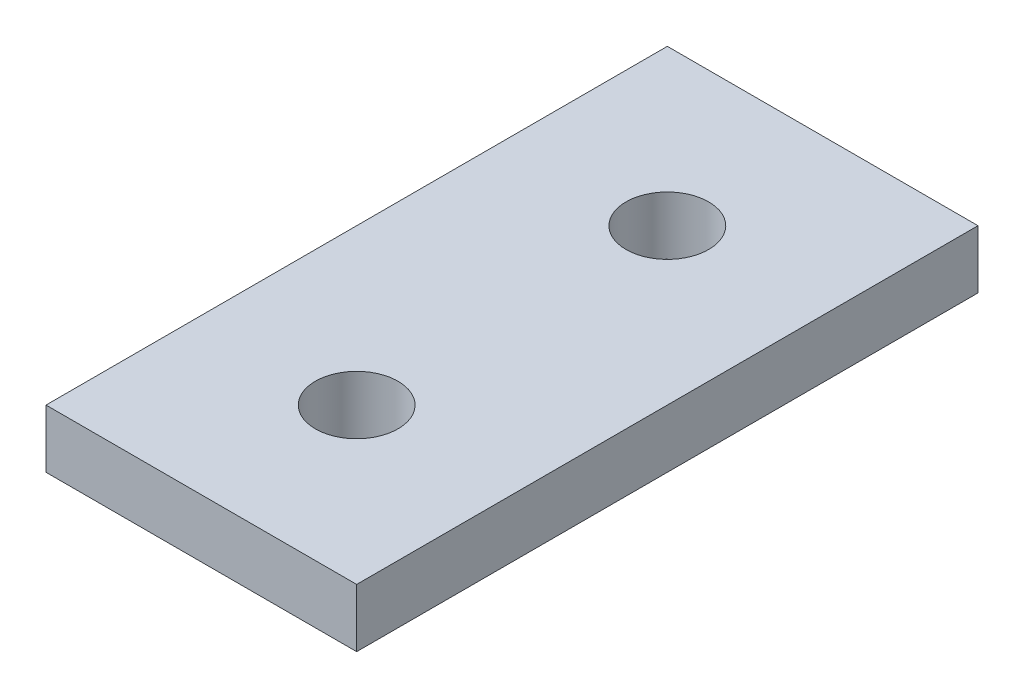
ISO-10303-21;
HEADER;
FILE_DESCRIPTION(('STEP AP214'),'2;1');
FILE_NAME('part.step','',(''),(''),'','','');
FILE_SCHEMA(('AUTOMOTIVE_DESIGN { 1 0 10303 214 1 1 1 1 }'));
ENDSEC;
DATA;
#1=APPLICATION_CONTEXT('core data for automotive mechanical design processes');
#2=APPLICATION_PROTOCOL_DEFINITION('international standard','automotive_design',2000,#1);
#3=PRODUCT_CONTEXT('',#1,'mechanical');
#4=PRODUCT('Part','Part','',(#3));
#5=PRODUCT_RELATED_PRODUCT_CATEGORY('part','',(#4));
#6=PRODUCT_DEFINITION_FORMATION('','',#4);
#7=PRODUCT_DEFINITION_CONTEXT('part definition',#1,'design');
#8=PRODUCT_DEFINITION('design','',#6,#7);
#9=PRODUCT_DEFINITION_SHAPE('','',#8);
#10=(LENGTH_UNIT() NAMED_UNIT(*) SI_UNIT(.MILLI.,.METRE.));
#11=(NAMED_UNIT(*) PLANE_ANGLE_UNIT() SI_UNIT($,.RADIAN.));
#12=(NAMED_UNIT(*) SI_UNIT($,.STERADIAN.) SOLID_ANGLE_UNIT());
#13=UNCERTAINTY_MEASURE_WITH_UNIT(LENGTH_MEASURE(1.E-05),#10,'distance_accuracy_value','');
#14=(GEOMETRIC_REPRESENTATION_CONTEXT(3) GLOBAL_UNCERTAINTY_ASSIGNED_CONTEXT((#13)) GLOBAL_UNIT_ASSIGNED_CONTEXT((#10,
#11,#12)) REPRESENTATION_CONTEXT('',''));
#15=CARTESIAN_POINT('',(0.,0.,0.));
#16=DIRECTION('',(0.,0.,1.));
#17=DIRECTION('',(1.,0.,0.));
#18=AXIS2_PLACEMENT_3D('',#15,#16,#17);
#19=CARTESIAN_POINT('',(0.,4.7625,0.));
#20=DIRECTION('',(0.,-1.,0.));
#21=DIRECTION('',(0.,0.,-1.));
#22=AXIS2_PLACEMENT_3D('',#19,#20,#21);
#23=PLANE('',#22);
#24=CARTESIAN_POINT('',(12.7,4.7625,-38.1));
#25=DIRECTION('',(0.,1.,0.));
#26=DIRECTION('',(0.,0.,1.));
#27=AXIS2_PLACEMENT_3D('',#24,#25,#26);
#28=CIRCLE('',#27,3.3782);
#29=CARTESIAN_POINT('',(12.7,4.7625,-34.7218));
#30=VERTEX_POINT('',#29);
#31=EDGE_CURVE('E99',#30,#30,#28,.T.);
#32=ORIENTED_EDGE('',*,*,#31,.F.);
#33=EDGE_LOOP('',(#32));
#34=FACE_BOUND('',#33,.T.);
#35=DIRECTION('',(0.,0.,1.));
#36=VECTOR('',#35,1.);
#37=CARTESIAN_POINT('',(0.,4.7625,0.));
#38=LINE('',#37,#36);
#39=CARTESIAN_POINT('',(0.,4.7625,-50.8));
#40=VERTEX_POINT('',#39);
#41=CARTESIAN_POINT('',(0.,4.7625,0.));
#42=VERTEX_POINT('',#41);
#43=EDGE_CURVE('E84',#40,#42,#38,.T.);
#44=ORIENTED_EDGE('',*,*,#43,.T.);
#45=DIRECTION('',(1.,0.,0.));
#46=VECTOR('',#45,1.);
#47=CARTESIAN_POINT('',(0.,4.7625,0.));
#48=LINE('',#47,#46);
#49=CARTESIAN_POINT('',(25.4,4.7625,0.));
#50=VERTEX_POINT('',#49);
#51=EDGE_CURVE('E79',#42,#50,#48,.T.);
#52=ORIENTED_EDGE('',*,*,#51,.T.);
#53=DIRECTION('',(0.,0.,-1.));
#54=VECTOR('',#53,1.);
#55=CARTESIAN_POINT('',(25.4,4.7625,0.));
#56=LINE('',#55,#54);
#57=CARTESIAN_POINT('',(25.4,4.7625,-50.8));
#58=VERTEX_POINT('',#57);
#59=EDGE_CURVE('E82',#50,#58,#56,.T.);
#60=ORIENTED_EDGE('',*,*,#59,.T.);
#61=DIRECTION('',(-1.,0.,0.));
#62=VECTOR('',#61,1.);
#63=CARTESIAN_POINT('',(0.,4.7625,-50.8));
#64=LINE('',#63,#62);
#65=EDGE_CURVE('E49',#58,#40,#64,.T.);
#66=ORIENTED_EDGE('',*,*,#65,.T.);
#67=EDGE_LOOP('',(#44,#52,#60,#66));
#68=FACE_BOUND('',#67,.T.);
#69=CARTESIAN_POINT('',(12.7,4.7625,-12.7));
#70=DIRECTION('',(0.,1.,0.));
#71=DIRECTION('',(0.,0.,1.));
#72=AXIS2_PLACEMENT_3D('',#69,#70,#71);
#73=CIRCLE('',#72,3.3782);
#74=CARTESIAN_POINT('',(12.7,4.7625,-9.3218));
#75=VERTEX_POINT('',#74);
#76=EDGE_CURVE('E114',#75,#75,#73,.T.);
#77=ORIENTED_EDGE('',*,*,#76,.F.);
#78=EDGE_LOOP('',(#77));
#79=FACE_BOUND('',#78,.T.);
#80=ADVANCED_FACE('F32',(#34,#68,#79),#23,.F.);
#81=CARTESIAN_POINT('',(0.,0.,0.));
#82=DIRECTION('',(0.,-1.,0.));
#83=DIRECTION('',(0.,0.,-1.));
#84=AXIS2_PLACEMENT_3D('',#81,#82,#83);
#85=PLANE('',#84);
#86=CARTESIAN_POINT('',(12.7,0.,-38.1));
#87=DIRECTION('',(0.,1.,0.));
#88=DIRECTION('',(0.,0.,1.));
#89=AXIS2_PLACEMENT_3D('',#86,#87,#88);
#90=CIRCLE('',#89,3.3782);
#91=CARTESIAN_POINT('',(12.7,0.,-34.7218));
#92=VERTEX_POINT('',#91);
#93=EDGE_CURVE('E111',#92,#92,#90,.T.);
#94=ORIENTED_EDGE('',*,*,#93,.T.);
#95=EDGE_LOOP('',(#94));
#96=FACE_BOUND('',#95,.T.);
#97=DIRECTION('',(0.,0.,1.));
#98=VECTOR('',#97,1.);
#99=CARTESIAN_POINT('',(0.,0.,0.));
#100=LINE('',#99,#98);
#101=CARTESIAN_POINT('',(0.,0.,-50.8));
#102=VERTEX_POINT('',#101);
#103=CARTESIAN_POINT('',(0.,0.,0.));
#104=VERTEX_POINT('',#103);
#105=EDGE_CURVE('E96',#102,#104,#100,.T.);
#106=ORIENTED_EDGE('',*,*,#105,.F.);
#107=DIRECTION('',(-1.,0.,0.));
#108=VECTOR('',#107,1.);
#109=CARTESIAN_POINT('',(0.,0.,-50.8));
#110=LINE('',#109,#108);
#111=CARTESIAN_POINT('',(25.4,0.,-50.8));
#112=VERTEX_POINT('',#111);
#113=EDGE_CURVE('E72',#112,#102,#110,.T.);
#114=ORIENTED_EDGE('',*,*,#113,.F.);
#115=DIRECTION('',(0.,0.,-1.));
#116=VECTOR('',#115,1.);
#117=CARTESIAN_POINT('',(25.4,0.,0.));
#118=LINE('',#117,#116);
#119=CARTESIAN_POINT('',(25.4,0.,0.));
#120=VERTEX_POINT('',#119);
#121=EDGE_CURVE('E66',#120,#112,#118,.T.);
#122=ORIENTED_EDGE('',*,*,#121,.F.);
#123=DIRECTION('',(1.,0.,0.));
#124=VECTOR('',#123,1.);
#125=CARTESIAN_POINT('',(0.,0.,0.));
#126=LINE('',#125,#124);
#127=EDGE_CURVE('E88',#104,#120,#126,.T.);
#128=ORIENTED_EDGE('',*,*,#127,.F.);
#129=EDGE_LOOP('',(#106,#114,#122,#128));
#130=FACE_BOUND('',#129,.T.);
#131=CARTESIAN_POINT('',(12.7,0.,-12.7));
#132=DIRECTION('',(0.,1.,0.));
#133=DIRECTION('',(0.,0.,1.));
#134=AXIS2_PLACEMENT_3D('',#131,#132,#133);
#135=CIRCLE('',#134,3.3782);
#136=CARTESIAN_POINT('',(12.7,0.,-9.3218));
#137=VERTEX_POINT('',#136);
#138=EDGE_CURVE('E117',#137,#137,#135,.T.);
#139=ORIENTED_EDGE('',*,*,#138,.T.);
#140=EDGE_LOOP('',(#139));
#141=FACE_BOUND('',#140,.T.);
#142=ADVANCED_FACE('F107',(#96,#130,#141),#85,.T.);
#143=CARTESIAN_POINT('',(0.,4.7625,0.));
#144=DIRECTION('',(1.,0.,0.));
#145=DIRECTION('',(0.,0.,-1.));
#146=AXIS2_PLACEMENT_3D('',#143,#144,#145);
#147=PLANE('',#146);
#148=ORIENTED_EDGE('',*,*,#105,.T.);
#149=DIRECTION('',(0.,-1.,0.));
#150=VECTOR('',#149,1.);
#151=CARTESIAN_POINT('',(0.,4.7625,0.));
#152=LINE('',#151,#150);
#153=EDGE_CURVE('E11',#42,#104,#152,.T.);
#154=ORIENTED_EDGE('',*,*,#153,.F.);
#155=ORIENTED_EDGE('',*,*,#43,.F.);
#156=DIRECTION('',(0.,-1.,0.));
#157=VECTOR('',#156,1.);
#158=CARTESIAN_POINT('',(0.,4.7625,-50.8));
#159=LINE('',#158,#157);
#160=EDGE_CURVE('E92',#40,#102,#159,.T.);
#161=ORIENTED_EDGE('',*,*,#160,.T.);
#162=EDGE_LOOP('',(#148,#154,#155,#161));
#163=FACE_BOUND('',#162,.T.);
#164=ADVANCED_FACE('F34',(#163),#147,.F.);
#165=CARTESIAN_POINT('',(0.,4.7625,0.));
#166=DIRECTION('',(0.,0.,-1.));
#167=DIRECTION('',(-1.,0.,0.));
#168=AXIS2_PLACEMENT_3D('',#165,#166,#167);
#169=PLANE('',#168);
#170=ORIENTED_EDGE('',*,*,#127,.T.);
#171=DIRECTION('',(0.,-1.,0.));
#172=VECTOR('',#171,1.);
#173=CARTESIAN_POINT('',(25.4,4.7625,0.));
#174=LINE('',#173,#172);
#175=EDGE_CURVE('E41',#50,#120,#174,.T.);
#176=ORIENTED_EDGE('',*,*,#175,.F.);
#177=ORIENTED_EDGE('',*,*,#51,.F.);
#178=ORIENTED_EDGE('',*,*,#153,.T.);
#179=EDGE_LOOP('',(#170,#176,#177,#178));
#180=FACE_BOUND('',#179,.T.);
#181=ADVANCED_FACE('F87',(#180),#169,.F.);
#182=CARTESIAN_POINT('',(25.4,4.7625,0.));
#183=DIRECTION('',(-1.,0.,0.));
#184=DIRECTION('',(0.,0.,1.));
#185=AXIS2_PLACEMENT_3D('',#182,#183,#184);
#186=PLANE('',#185);
#187=ORIENTED_EDGE('',*,*,#121,.T.);
#188=DIRECTION('',(0.,-1.,0.));
#189=VECTOR('',#188,1.);
#190=CARTESIAN_POINT('',(25.4,4.7625,-50.8));
#191=LINE('',#190,#189);
#192=EDGE_CURVE('E89',#58,#112,#191,.T.);
#193=ORIENTED_EDGE('',*,*,#192,.F.);
#194=ORIENTED_EDGE('',*,*,#59,.F.);
#195=ORIENTED_EDGE('',*,*,#175,.T.);
#196=EDGE_LOOP('',(#187,#193,#194,#195));
#197=FACE_BOUND('',#196,.T.);
#198=ADVANCED_FACE('F90',(#197),#186,.F.);
#199=CARTESIAN_POINT('',(0.,4.7625,-50.8));
#200=DIRECTION('',(0.,0.,1.));
#201=DIRECTION('',(1.,0.,0.));
#202=AXIS2_PLACEMENT_3D('',#199,#200,#201);
#203=PLANE('',#202);
#204=ORIENTED_EDGE('',*,*,#113,.T.);
#205=ORIENTED_EDGE('',*,*,#160,.F.);
#206=ORIENTED_EDGE('',*,*,#65,.F.);
#207=ORIENTED_EDGE('',*,*,#192,.T.);
#208=EDGE_LOOP('',(#204,#205,#206,#207));
#209=FACE_BOUND('',#208,.T.);
#210=ADVANCED_FACE('F104',(#209),#203,.F.);
#211=CARTESIAN_POINT('',(12.7,4.7625,-38.1));
#212=DIRECTION('',(0.,-1.,0.));
#213=DIRECTION('',(0.,0.,-1.));
#214=AXIS2_PLACEMENT_3D('',#211,#212,#213);
#215=CYLINDRICAL_SURFACE('',#214,3.3782);
#216=ORIENTED_EDGE('',*,*,#31,.T.);
#217=EDGE_LOOP('',(#216));
#218=FACE_BOUND('',#217,.T.);
#219=ORIENTED_EDGE('',*,*,#93,.F.);
#220=EDGE_LOOP('',(#219));
#221=FACE_BOUND('',#220,.T.);
#222=ADVANCED_FACE('F135',(#218,#221),#215,.F.);
#223=CARTESIAN_POINT('',(12.7,4.7625,-12.7));
#224=DIRECTION('',(0.,-1.,0.));
#225=DIRECTION('',(0.,0.,-1.));
#226=AXIS2_PLACEMENT_3D('',#223,#224,#225);
#227=CYLINDRICAL_SURFACE('',#226,3.3782);
#228=ORIENTED_EDGE('',*,*,#76,.T.);
#229=EDGE_LOOP('',(#228));
#230=FACE_BOUND('',#229,.T.);
#231=ORIENTED_EDGE('',*,*,#138,.F.);
#232=EDGE_LOOP('',(#231));
#233=FACE_BOUND('',#232,.T.);
#234=ADVANCED_FACE('F123',(#230,#233),#227,.F.);
#235=CLOSED_SHELL('',(#80,#142,#164,#181,#198,#210,#222,#234));
#236=MANIFOLD_SOLID_BREP('B2',#235);
#237=ADVANCED_BREP_SHAPE_REPRESENTATION('',(#18,#236),#14);
#238=SHAPE_DEFINITION_REPRESENTATION(#9,#237);
ENDSEC;
END-ISO-10303-21;
